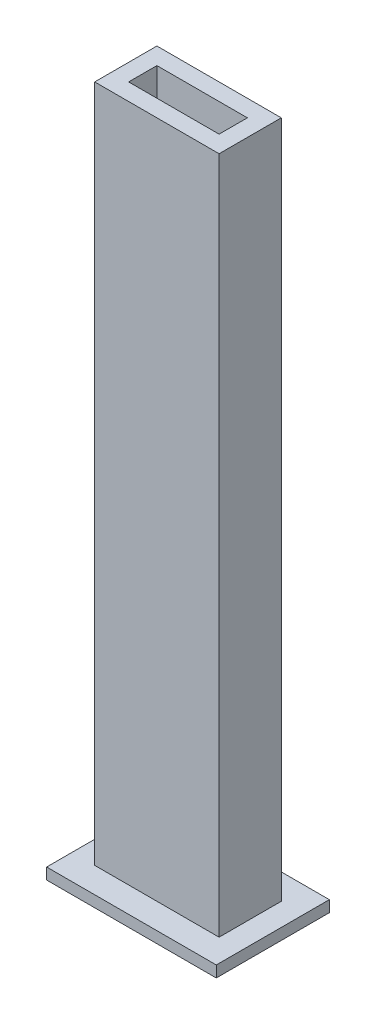
ISO-10303-21;
HEADER;
FILE_DESCRIPTION(('STEP AP214'),'2;1');
FILE_NAME('part.step','',(''),(''),'','','');
FILE_SCHEMA(('AUTOMOTIVE_DESIGN { 1 0 10303 214 1 1 1 1 }'));
ENDSEC;
DATA;
#1=APPLICATION_CONTEXT('core data for automotive mechanical design processes');
#2=APPLICATION_PROTOCOL_DEFINITION('international standard','automotive_design',2000,#1);
#3=PRODUCT_CONTEXT('',#1,'mechanical');
#4=PRODUCT('Part','Part','',(#3));
#5=PRODUCT_RELATED_PRODUCT_CATEGORY('part','',(#4));
#6=PRODUCT_DEFINITION_FORMATION('','',#4);
#7=PRODUCT_DEFINITION_CONTEXT('part definition',#1,'design');
#8=PRODUCT_DEFINITION('design','',#6,#7);
#9=PRODUCT_DEFINITION_SHAPE('','',#8);
#10=(LENGTH_UNIT() NAMED_UNIT(*) SI_UNIT(.MILLI.,.METRE.));
#11=(NAMED_UNIT(*) PLANE_ANGLE_UNIT() SI_UNIT($,.RADIAN.));
#12=(NAMED_UNIT(*) SI_UNIT($,.STERADIAN.) SOLID_ANGLE_UNIT());
#13=UNCERTAINTY_MEASURE_WITH_UNIT(LENGTH_MEASURE(1.E-05),#10,'distance_accuracy_value','');
#14=(GEOMETRIC_REPRESENTATION_CONTEXT(3) GLOBAL_UNCERTAINTY_ASSIGNED_CONTEXT((#13)) GLOBAL_UNIT_ASSIGNED_CONTEXT((#10,
#11,#12)) REPRESENTATION_CONTEXT('',''));
#15=CARTESIAN_POINT('',(0.,0.,0.));
#16=DIRECTION('',(0.,0.,1.));
#17=DIRECTION('',(1.,0.,0.));
#18=AXIS2_PLACEMENT_3D('',#15,#16,#17);
#19=CARTESIAN_POINT('',(0.,2.,0.));
#20=DIRECTION('',(0.,-1.,0.));
#21=DIRECTION('',(0.,0.,-1.));
#22=AXIS2_PLACEMENT_3D('',#19,#20,#21);
#23=PLANE('',#22);
#24=DIRECTION('',(0.,0.,-1.));
#25=VECTOR('',#24,1.);
#26=CARTESIAN_POINT('',(15.,2.,10.));
#27=LINE('',#26,#25);
#28=CARTESIAN_POINT('',(15.,2.,10.));
#29=VERTEX_POINT('',#28);
#30=CARTESIAN_POINT('',(15.,2.,-10.));
#31=VERTEX_POINT('',#30);
#32=EDGE_CURVE('E226',#29,#31,#27,.T.);
#33=ORIENTED_EDGE('',*,*,#32,.T.);
#34=DIRECTION('',(-1.,0.,0.));
#35=VECTOR('',#34,1.);
#36=CARTESIAN_POINT('',(-15.,2.,-10.));
#37=LINE('',#36,#35);
#38=CARTESIAN_POINT('',(-15.,2.,-10.));
#39=VERTEX_POINT('',#38);
#40=EDGE_CURVE('E230',#31,#39,#37,.T.);
#41=ORIENTED_EDGE('',*,*,#40,.T.);
#42=DIRECTION('',(0.,0.,1.));
#43=VECTOR('',#42,1.);
#44=CARTESIAN_POINT('',(-15.,2.,10.));
#45=LINE('',#44,#43);
#46=CARTESIAN_POINT('',(-15.,2.,10.));
#47=VERTEX_POINT('',#46);
#48=EDGE_CURVE('E234',#39,#47,#45,.T.);
#49=ORIENTED_EDGE('',*,*,#48,.T.);
#50=DIRECTION('',(1.,0.,0.));
#51=VECTOR('',#50,1.);
#52=CARTESIAN_POINT('',(-15.,2.,10.));
#53=LINE('',#52,#51);
#54=EDGE_CURVE('E237',#47,#29,#53,.T.);
#55=ORIENTED_EDGE('',*,*,#54,.T.);
#56=EDGE_LOOP('',(#33,#41,#49,#55));
#57=FACE_BOUND('',#56,.T.);
#58=DIRECTION('',(0.,0.,1.));
#59=VECTOR('',#58,1.);
#60=CARTESIAN_POINT('',(-11.,2.,5.5));
#61=LINE('',#60,#59);
#62=CARTESIAN_POINT('',(-11.,2.,-5.5));
#63=VERTEX_POINT('',#62);
#64=CARTESIAN_POINT('',(-11.,2.,5.5));
#65=VERTEX_POINT('',#64);
#66=EDGE_CURVE('E183',#63,#65,#61,.T.);
#67=ORIENTED_EDGE('',*,*,#66,.F.);
#68=DIRECTION('',(-1.,0.,0.));
#69=VECTOR('',#68,1.);
#70=CARTESIAN_POINT('',(-11.,2.,-5.5));
#71=LINE('',#70,#69);
#72=CARTESIAN_POINT('',(11.,2.,-5.5));
#73=VERTEX_POINT('',#72);
#74=EDGE_CURVE('E189',#73,#63,#71,.T.);
#75=ORIENTED_EDGE('',*,*,#74,.F.);
#76=DIRECTION('',(0.,0.,-1.));
#77=VECTOR('',#76,1.);
#78=CARTESIAN_POINT('',(11.,2.,5.5));
#79=LINE('',#78,#77);
#80=CARTESIAN_POINT('',(11.,2.,5.5));
#81=VERTEX_POINT('',#80);
#82=EDGE_CURVE('E204',#81,#73,#79,.T.);
#83=ORIENTED_EDGE('',*,*,#82,.F.);
#84=DIRECTION('',(1.,0.,0.));
#85=VECTOR('',#84,1.);
#86=CARTESIAN_POINT('',(-11.,2.,5.5));
#87=LINE('',#86,#85);
#88=EDGE_CURVE('E67',#65,#81,#87,.T.);
#89=ORIENTED_EDGE('',*,*,#88,.F.);
#90=EDGE_LOOP('',(#67,#75,#83,#89));
#91=FACE_BOUND('',#90,.T.);
#92=ADVANCED_FACE('F43',(#57,#91),#23,.F.);
#93=CARTESIAN_POINT('',(15.,2.,10.));
#94=DIRECTION('',(-1.,0.,0.));
#95=DIRECTION('',(0.,0.,1.));
#96=AXIS2_PLACEMENT_3D('',#93,#94,#95);
#97=PLANE('',#96);
#98=DIRECTION('',(0.,0.,-1.));
#99=VECTOR('',#98,1.);
#100=CARTESIAN_POINT('',(15.,0.,10.));
#101=LINE('',#100,#99);
#102=CARTESIAN_POINT('',(15.,0.,10.));
#103=VERTEX_POINT('',#102);
#104=CARTESIAN_POINT('',(15.,0.,-10.));
#105=VERTEX_POINT('',#104);
#106=EDGE_CURVE('E225',#103,#105,#101,.T.);
#107=ORIENTED_EDGE('',*,*,#106,.T.);
#108=DIRECTION('',(0.,-1.,0.));
#109=VECTOR('',#108,1.);
#110=CARTESIAN_POINT('',(15.,2.,-10.));
#111=LINE('',#110,#109);
#112=EDGE_CURVE('E11',#31,#105,#111,.T.);
#113=ORIENTED_EDGE('',*,*,#112,.F.);
#114=ORIENTED_EDGE('',*,*,#32,.F.);
#115=DIRECTION('',(0.,-1.,0.));
#116=VECTOR('',#115,1.);
#117=CARTESIAN_POINT('',(15.,2.,10.));
#118=LINE('',#117,#116);
#119=EDGE_CURVE('E240',#29,#103,#118,.T.);
#120=ORIENTED_EDGE('',*,*,#119,.T.);
#121=EDGE_LOOP('',(#107,#113,#114,#120));
#122=FACE_BOUND('',#121,.T.);
#123=ADVANCED_FACE('F45',(#122),#97,.F.);
#124=CARTESIAN_POINT('',(-15.,2.,-10.));
#125=DIRECTION('',(0.,0.,1.));
#126=DIRECTION('',(1.,0.,0.));
#127=AXIS2_PLACEMENT_3D('',#124,#125,#126);
#128=PLANE('',#127);
#129=DIRECTION('',(-1.,0.,0.));
#130=VECTOR('',#129,1.);
#131=CARTESIAN_POINT('',(-15.,0.,-10.));
#132=LINE('',#131,#130);
#133=CARTESIAN_POINT('',(-15.,0.,-10.));
#134=VERTEX_POINT('',#133);
#135=EDGE_CURVE('E244',#105,#134,#132,.T.);
#136=ORIENTED_EDGE('',*,*,#135,.T.);
#137=DIRECTION('',(0.,-1.,0.));
#138=VECTOR('',#137,1.);
#139=CARTESIAN_POINT('',(-15.,2.,-10.));
#140=LINE('',#139,#138);
#141=EDGE_CURVE('E52',#39,#134,#140,.T.);
#142=ORIENTED_EDGE('',*,*,#141,.F.);
#143=ORIENTED_EDGE('',*,*,#40,.F.);
#144=ORIENTED_EDGE('',*,*,#112,.T.);
#145=EDGE_LOOP('',(#136,#142,#143,#144));
#146=FACE_BOUND('',#145,.T.);
#147=ADVANCED_FACE('F277',(#146),#128,.F.);
#148=CARTESIAN_POINT('',(-15.,2.,10.));
#149=DIRECTION('',(1.,0.,0.));
#150=DIRECTION('',(0.,0.,-1.));
#151=AXIS2_PLACEMENT_3D('',#148,#149,#150);
#152=PLANE('',#151);
#153=DIRECTION('',(0.,0.,1.));
#154=VECTOR('',#153,1.);
#155=CARTESIAN_POINT('',(-15.,0.,10.));
#156=LINE('',#155,#154);
#157=CARTESIAN_POINT('',(-15.,0.,10.));
#158=VERTEX_POINT('',#157);
#159=EDGE_CURVE('E247',#134,#158,#156,.T.);
#160=ORIENTED_EDGE('',*,*,#159,.T.);
#161=DIRECTION('',(0.,-1.,0.));
#162=VECTOR('',#161,1.);
#163=CARTESIAN_POINT('',(-15.,2.,10.));
#164=LINE('',#163,#162);
#165=EDGE_CURVE('E255',#47,#158,#164,.T.);
#166=ORIENTED_EDGE('',*,*,#165,.F.);
#167=ORIENTED_EDGE('',*,*,#48,.F.);
#168=ORIENTED_EDGE('',*,*,#141,.T.);
#169=EDGE_LOOP('',(#160,#166,#167,#168));
#170=FACE_BOUND('',#169,.T.);
#171=ADVANCED_FACE('F264',(#170),#152,.F.);
#172=CARTESIAN_POINT('',(-15.,2.,10.));
#173=DIRECTION('',(0.,0.,-1.));
#174=DIRECTION('',(-1.,0.,0.));
#175=AXIS2_PLACEMENT_3D('',#172,#173,#174);
#176=PLANE('',#175);
#177=DIRECTION('',(1.,0.,0.));
#178=VECTOR('',#177,1.);
#179=CARTESIAN_POINT('',(-15.,0.,10.));
#180=LINE('',#179,#178);
#181=EDGE_CURVE('E231',#158,#103,#180,.T.);
#182=ORIENTED_EDGE('',*,*,#181,.T.);
#183=ORIENTED_EDGE('',*,*,#119,.F.);
#184=ORIENTED_EDGE('',*,*,#54,.F.);
#185=ORIENTED_EDGE('',*,*,#165,.T.);
#186=EDGE_LOOP('',(#182,#183,#184,#185));
#187=FACE_BOUND('',#186,.T.);
#188=ADVANCED_FACE('F271',(#187),#176,.F.);
#189=CARTESIAN_POINT('',(0.,0.,0.));
#190=DIRECTION('',(0.,-1.,0.));
#191=DIRECTION('',(0.,0.,-1.));
#192=AXIS2_PLACEMENT_3D('',#189,#190,#191);
#193=PLANE('',#192);
#194=DIRECTION('',(0.,0.,1.));
#195=VECTOR('',#194,1.);
#196=CARTESIAN_POINT('',(-8.,0.,-2.5));
#197=LINE('',#196,#195);
#198=CARTESIAN_POINT('',(-8.,0.,-2.5));
#199=VERTEX_POINT('',#198);
#200=CARTESIAN_POINT('',(-8.,0.,2.5));
#201=VERTEX_POINT('',#200);
#202=EDGE_CURVE('E138',#199,#201,#197,.T.);
#203=ORIENTED_EDGE('',*,*,#202,.T.);
#204=DIRECTION('',(1.,0.,0.));
#205=VECTOR('',#204,1.);
#206=CARTESIAN_POINT('',(-8.,0.,2.5));
#207=LINE('',#206,#205);
#208=CARTESIAN_POINT('',(8.,0.,2.5));
#209=VERTEX_POINT('',#208);
#210=EDGE_CURVE('E147',#201,#209,#207,.T.);
#211=ORIENTED_EDGE('',*,*,#210,.T.);
#212=DIRECTION('',(0.,0.,-1.));
#213=VECTOR('',#212,1.);
#214=CARTESIAN_POINT('',(8.,0.,-2.5));
#215=LINE('',#214,#213);
#216=CARTESIAN_POINT('',(8.,0.,-2.5));
#217=VERTEX_POINT('',#216);
#218=EDGE_CURVE('E152',#209,#217,#215,.T.);
#219=ORIENTED_EDGE('',*,*,#218,.T.);
#220=DIRECTION('',(-1.,0.,0.));
#221=VECTOR('',#220,1.);
#222=CARTESIAN_POINT('',(-8.,0.,-2.5));
#223=LINE('',#222,#221);
#224=EDGE_CURVE('E157',#217,#199,#223,.T.);
#225=ORIENTED_EDGE('',*,*,#224,.T.);
#226=EDGE_LOOP('',(#203,#211,#219,#225));
#227=FACE_BOUND('',#226,.T.);
#228=ORIENTED_EDGE('',*,*,#106,.F.);
#229=ORIENTED_EDGE('',*,*,#181,.F.);
#230=ORIENTED_EDGE('',*,*,#159,.F.);
#231=ORIENTED_EDGE('',*,*,#135,.F.);
#232=EDGE_LOOP('',(#228,#229,#230,#231));
#233=FACE_BOUND('',#232,.T.);
#234=ADVANCED_FACE('F154',(#227,#233),#193,.T.);
#235=CARTESIAN_POINT('',(0.,122.,0.));
#236=DIRECTION('',(0.,-1.,0.));
#237=DIRECTION('',(0.,0.,-1.));
#238=AXIS2_PLACEMENT_3D('',#235,#236,#237);
#239=PLANE('',#238);
#240=DIRECTION('',(0.,0.,1.));
#241=VECTOR('',#240,1.);
#242=CARTESIAN_POINT('',(-11.,122.,5.5));
#243=LINE('',#242,#241);
#244=CARTESIAN_POINT('',(-11.,122.,-5.5));
#245=VERTEX_POINT('',#244);
#246=CARTESIAN_POINT('',(-11.,122.,5.5));
#247=VERTEX_POINT('',#246);
#248=EDGE_CURVE('E184',#245,#247,#243,.T.);
#249=ORIENTED_EDGE('',*,*,#248,.T.);
#250=DIRECTION('',(1.,0.,0.));
#251=VECTOR('',#250,1.);
#252=CARTESIAN_POINT('',(-11.,122.,5.5));
#253=LINE('',#252,#251);
#254=CARTESIAN_POINT('',(11.,122.,5.5));
#255=VERTEX_POINT('',#254);
#256=EDGE_CURVE('E188',#247,#255,#253,.T.);
#257=ORIENTED_EDGE('',*,*,#256,.T.);
#258=DIRECTION('',(0.,0.,-1.));
#259=VECTOR('',#258,1.);
#260=CARTESIAN_POINT('',(11.,122.,5.5));
#261=LINE('',#260,#259);
#262=CARTESIAN_POINT('',(11.,122.,-5.5));
#263=VERTEX_POINT('',#262);
#264=EDGE_CURVE('E192',#255,#263,#261,.T.);
#265=ORIENTED_EDGE('',*,*,#264,.T.);
#266=DIRECTION('',(-1.,0.,0.));
#267=VECTOR('',#266,1.);
#268=CARTESIAN_POINT('',(-11.,122.,-5.5));
#269=LINE('',#268,#267);
#270=EDGE_CURVE('E195',#263,#245,#269,.T.);
#271=ORIENTED_EDGE('',*,*,#270,.T.);
#272=EDGE_LOOP('',(#249,#257,#265,#271));
#273=FACE_BOUND('',#272,.T.);
#274=DIRECTION('',(0.,0.,-1.));
#275=VECTOR('',#274,1.);
#276=CARTESIAN_POINT('',(8.,122.,2.5));
#277=LINE('',#276,#275);
#278=CARTESIAN_POINT('',(8.,122.,2.5));
#279=VERTEX_POINT('',#278);
#280=CARTESIAN_POINT('',(8.,122.,-2.5));
#281=VERTEX_POINT('',#280);
#282=EDGE_CURVE('E165',#279,#281,#277,.T.);
#283=ORIENTED_EDGE('',*,*,#282,.F.);
#284=DIRECTION('',(1.,0.,0.));
#285=VECTOR('',#284,1.);
#286=CARTESIAN_POINT('',(-8.,122.,2.5));
#287=LINE('',#286,#285);
#288=CARTESIAN_POINT('',(-8.,122.,2.5));
#289=VERTEX_POINT('',#288);
#290=EDGE_CURVE('E173',#289,#279,#287,.T.);
#291=ORIENTED_EDGE('',*,*,#290,.F.);
#292=DIRECTION('',(0.,0.,1.));
#293=VECTOR('',#292,1.);
#294=CARTESIAN_POINT('',(-8.,122.,2.5));
#295=LINE('',#294,#293);
#296=CARTESIAN_POINT('',(-8.,122.,-2.5));
#297=VERTEX_POINT('',#296);
#298=EDGE_CURVE('E141',#297,#289,#295,.T.);
#299=ORIENTED_EDGE('',*,*,#298,.F.);
#300=DIRECTION('',(-1.,0.,0.));
#301=VECTOR('',#300,1.);
#302=CARTESIAN_POINT('',(-8.,122.,-2.5));
#303=LINE('',#302,#301);
#304=EDGE_CURVE('E168',#281,#297,#303,.T.);
#305=ORIENTED_EDGE('',*,*,#304,.F.);
#306=EDGE_LOOP('',(#283,#291,#299,#305));
#307=FACE_BOUND('',#306,.T.);
#308=ADVANCED_FACE('F294',(#273,#307),#239,.F.);
#309=CARTESIAN_POINT('',(-11.,122.,5.5));
#310=DIRECTION('',(1.,0.,0.));
#311=DIRECTION('',(0.,0.,-1.));
#312=AXIS2_PLACEMENT_3D('',#309,#310,#311);
#313=PLANE('',#312);
#314=ORIENTED_EDGE('',*,*,#66,.T.);
#315=DIRECTION('',(0.,-1.,0.));
#316=VECTOR('',#315,1.);
#317=CARTESIAN_POINT('',(-11.,122.,5.5));
#318=LINE('',#317,#316);
#319=EDGE_CURVE('E222',#247,#65,#318,.T.);
#320=ORIENTED_EDGE('',*,*,#319,.F.);
#321=ORIENTED_EDGE('',*,*,#248,.F.);
#322=DIRECTION('',(0.,-1.,0.));
#323=VECTOR('',#322,1.);
#324=CARTESIAN_POINT('',(-11.,122.,-5.5));
#325=LINE('',#324,#323);
#326=EDGE_CURVE('E198',#245,#63,#325,.T.);
#327=ORIENTED_EDGE('',*,*,#326,.T.);
#328=EDGE_LOOP('',(#314,#320,#321,#327));
#329=FACE_BOUND('',#328,.T.);
#330=ADVANCED_FACE('F290',(#329),#313,.F.);
#331=CARTESIAN_POINT('',(-11.,122.,5.5));
#332=DIRECTION('',(0.,0.,-1.));
#333=DIRECTION('',(-1.,0.,0.));
#334=AXIS2_PLACEMENT_3D('',#331,#332,#333);
#335=PLANE('',#334);
#336=ORIENTED_EDGE('',*,*,#88,.T.);
#337=DIRECTION('',(0.,-1.,0.));
#338=VECTOR('',#337,1.);
#339=CARTESIAN_POINT('',(11.,122.,5.5));
#340=LINE('',#339,#338);
#341=EDGE_CURVE('E218',#255,#81,#340,.T.);
#342=ORIENTED_EDGE('',*,*,#341,.F.);
#343=ORIENTED_EDGE('',*,*,#256,.F.);
#344=ORIENTED_EDGE('',*,*,#319,.T.);
#345=EDGE_LOOP('',(#336,#342,#343,#344));
#346=FACE_BOUND('',#345,.T.);
#347=ADVANCED_FACE('F319',(#346),#335,.F.);
#348=CARTESIAN_POINT('',(11.,122.,5.5));
#349=DIRECTION('',(-1.,0.,0.));
#350=DIRECTION('',(0.,0.,1.));
#351=AXIS2_PLACEMENT_3D('',#348,#349,#350);
#352=PLANE('',#351);
#353=ORIENTED_EDGE('',*,*,#82,.T.);
#354=DIRECTION('',(0.,-1.,0.));
#355=VECTOR('',#354,1.);
#356=CARTESIAN_POINT('',(11.,122.,-5.5));
#357=LINE('',#356,#355);
#358=EDGE_CURVE('E214',#263,#73,#357,.T.);
#359=ORIENTED_EDGE('',*,*,#358,.F.);
#360=ORIENTED_EDGE('',*,*,#264,.F.);
#361=ORIENTED_EDGE('',*,*,#341,.T.);
#362=EDGE_LOOP('',(#353,#359,#360,#361));
#363=FACE_BOUND('',#362,.T.);
#364=ADVANCED_FACE('F326',(#363),#352,.F.);
#365=CARTESIAN_POINT('',(-11.,122.,-5.5));
#366=DIRECTION('',(0.,0.,1.));
#367=DIRECTION('',(1.,0.,0.));
#368=AXIS2_PLACEMENT_3D('',#365,#366,#367);
#369=PLANE('',#368);
#370=ORIENTED_EDGE('',*,*,#74,.T.);
#371=ORIENTED_EDGE('',*,*,#326,.F.);
#372=ORIENTED_EDGE('',*,*,#270,.F.);
#373=ORIENTED_EDGE('',*,*,#358,.T.);
#374=EDGE_LOOP('',(#370,#371,#372,#373));
#375=FACE_BOUND('',#374,.T.);
#376=ADVANCED_FACE('F333',(#375),#369,.F.);
#377=CARTESIAN_POINT('',(8.,122.,2.5));
#378=DIRECTION('',(-1.,0.,0.));
#379=DIRECTION('',(0.,0.,1.));
#380=AXIS2_PLACEMENT_3D('',#377,#378,#379);
#381=PLANE('',#380);
#382=DIRECTION('',(0.,-1.,0.));
#383=VECTOR('',#382,1.);
#384=CARTESIAN_POINT('',(8.,122.,-2.5));
#385=LINE('',#384,#383);
#386=EDGE_CURVE('E180',#281,#217,#385,.T.);
#387=ORIENTED_EDGE('',*,*,#386,.T.);
#388=ORIENTED_EDGE('',*,*,#218,.F.);
#389=DIRECTION('',(0.,-1.,0.));
#390=VECTOR('',#389,1.);
#391=CARTESIAN_POINT('',(8.,122.,2.5));
#392=LINE('',#391,#390);
#393=EDGE_CURVE('E59',#279,#209,#392,.T.);
#394=ORIENTED_EDGE('',*,*,#393,.F.);
#395=ORIENTED_EDGE('',*,*,#282,.T.);
#396=EDGE_LOOP('',(#387,#388,#394,#395));
#397=FACE_BOUND('',#396,.T.);
#398=ADVANCED_FACE('F340',(#397),#381,.T.);
#399=CARTESIAN_POINT('',(-8.,122.,-2.5));
#400=DIRECTION('',(0.,0.,1.));
#401=DIRECTION('',(1.,0.,0.));
#402=AXIS2_PLACEMENT_3D('',#399,#400,#401);
#403=PLANE('',#402);
#404=DIRECTION('',(0.,-1.,0.));
#405=VECTOR('',#404,1.);
#406=CARTESIAN_POINT('',(-8.,122.,-2.5));
#407=LINE('',#406,#405);
#408=EDGE_CURVE('E144',#297,#199,#407,.T.);
#409=ORIENTED_EDGE('',*,*,#408,.T.);
#410=ORIENTED_EDGE('',*,*,#224,.F.);
#411=ORIENTED_EDGE('',*,*,#386,.F.);
#412=ORIENTED_EDGE('',*,*,#304,.T.);
#413=EDGE_LOOP('',(#409,#410,#411,#412));
#414=FACE_BOUND('',#413,.T.);
#415=ADVANCED_FACE('F347',(#414),#403,.T.);
#416=CARTESIAN_POINT('',(-8.,122.,2.5));
#417=DIRECTION('',(1.,0.,0.));
#418=DIRECTION('',(0.,0.,-1.));
#419=AXIS2_PLACEMENT_3D('',#416,#417,#418);
#420=PLANE('',#419);
#421=DIRECTION('',(0.,-1.,0.));
#422=VECTOR('',#421,1.);
#423=CARTESIAN_POINT('',(-8.,122.,2.5));
#424=LINE('',#423,#422);
#425=EDGE_CURVE('E134',#289,#201,#424,.T.);
#426=ORIENTED_EDGE('',*,*,#425,.T.);
#427=ORIENTED_EDGE('',*,*,#202,.F.);
#428=ORIENTED_EDGE('',*,*,#408,.F.);
#429=ORIENTED_EDGE('',*,*,#298,.T.);
#430=EDGE_LOOP('',(#426,#427,#428,#429));
#431=FACE_BOUND('',#430,.T.);
#432=ADVANCED_FACE('F135',(#431),#420,.T.);
#433=CARTESIAN_POINT('',(-8.,122.,2.5));
#434=DIRECTION('',(0.,0.,-1.));
#435=DIRECTION('',(-1.,0.,0.));
#436=AXIS2_PLACEMENT_3D('',#433,#434,#435);
#437=PLANE('',#436);
#438=ORIENTED_EDGE('',*,*,#393,.T.);
#439=ORIENTED_EDGE('',*,*,#210,.F.);
#440=ORIENTED_EDGE('',*,*,#425,.F.);
#441=ORIENTED_EDGE('',*,*,#290,.T.);
#442=EDGE_LOOP('',(#438,#439,#440,#441));
#443=FACE_BOUND('',#442,.T.);
#444=ADVANCED_FACE('F148',(#443),#437,.T.);
#445=CLOSED_SHELL('',(#92,#123,#147,#171,#188,#234,#308,#330,#347,#364,#376,#398,#415,#432,#444));
#446=MANIFOLD_SOLID_BREP('B2',#445);
#447=ADVANCED_BREP_SHAPE_REPRESENTATION('',(#18,#446),#14);
#448=SHAPE_DEFINITION_REPRESENTATION(#9,#447);
ENDSEC;
END-ISO-10303-21;
